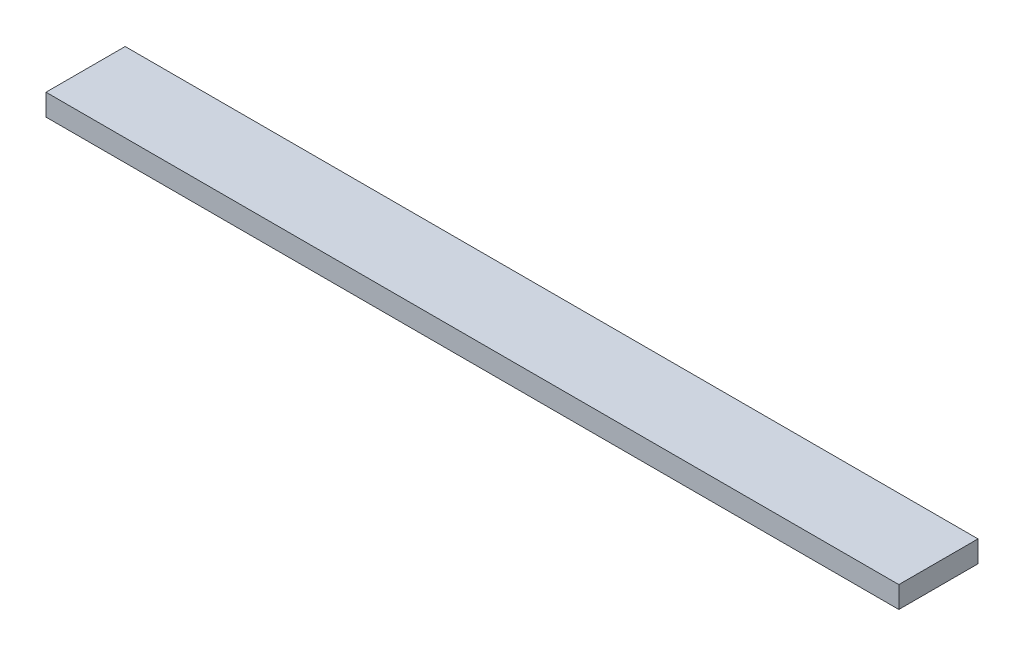
ISO-10303-21;
HEADER;
FILE_DESCRIPTION(('STEP AP214'),'2;1');
FILE_NAME('part.step','',(''),(''),'','','');
FILE_SCHEMA(('AUTOMOTIVE_DESIGN { 1 0 10303 214 1 1 1 1 }'));
ENDSEC;
DATA;
#1=APPLICATION_CONTEXT('core data for automotive mechanical design processes');
#2=APPLICATION_PROTOCOL_DEFINITION('international standard','automotive_design',2000,#1);
#3=PRODUCT_CONTEXT('',#1,'mechanical');
#4=PRODUCT('Part','Part','',(#3));
#5=PRODUCT_RELATED_PRODUCT_CATEGORY('part','',(#4));
#6=PRODUCT_DEFINITION_FORMATION('','',#4);
#7=PRODUCT_DEFINITION_CONTEXT('part definition',#1,'design');
#8=PRODUCT_DEFINITION('design','',#6,#7);
#9=PRODUCT_DEFINITION_SHAPE('','',#8);
#10=(LENGTH_UNIT() NAMED_UNIT(*) SI_UNIT(.MILLI.,.METRE.));
#11=(NAMED_UNIT(*) PLANE_ANGLE_UNIT() SI_UNIT($,.RADIAN.));
#12=(NAMED_UNIT(*) SI_UNIT($,.STERADIAN.) SOLID_ANGLE_UNIT());
#13=UNCERTAINTY_MEASURE_WITH_UNIT(LENGTH_MEASURE(1.E-05),#10,'distance_accuracy_value','');
#14=(GEOMETRIC_REPRESENTATION_CONTEXT(3) GLOBAL_UNCERTAINTY_ASSIGNED_CONTEXT((#13)) GLOBAL_UNIT_ASSIGNED_CONTEXT((#10,
#11,#12)) REPRESENTATION_CONTEXT('',''));
#15=CARTESIAN_POINT('',(0.,0.,0.));
#16=DIRECTION('',(0.,0.,1.));
#17=DIRECTION('',(1.,0.,0.));
#18=AXIS2_PLACEMENT_3D('',#15,#16,#17);
#19=CARTESIAN_POINT('',(0.,19.05,0.));
#20=DIRECTION('',(1.,0.,0.));
#21=DIRECTION('',(0.,0.,-1.));
#22=AXIS2_PLACEMENT_3D('',#19,#20,#21);
#23=PLANE('',#22);
#24=DIRECTION('',(0.,0.,1.));
#25=VECTOR('',#24,1.);
#26=CARTESIAN_POINT('',(0.,0.,0.));
#27=LINE('',#26,#25);
#28=CARTESIAN_POINT('',(0.,0.,-69.85));
#29=VERTEX_POINT('',#28);
#30=CARTESIAN_POINT('',(0.,0.,0.));
#31=VERTEX_POINT('',#30);
#32=EDGE_CURVE('E101',#29,#31,#27,.T.);
#33=ORIENTED_EDGE('',*,*,#32,.T.);
#34=DIRECTION('',(0.,-1.,0.));
#35=VECTOR('',#34,1.);
#36=CARTESIAN_POINT('',(0.,19.05,0.));
#37=LINE('',#36,#35);
#38=CARTESIAN_POINT('',(0.,19.05,0.));
#39=VERTEX_POINT('',#38);
#40=EDGE_CURVE('E11',#39,#31,#37,.T.);
#41=ORIENTED_EDGE('',*,*,#40,.F.);
#42=DIRECTION('',(0.,0.,1.));
#43=VECTOR('',#42,1.);
#44=CARTESIAN_POINT('',(0.,19.05,0.));
#45=LINE('',#44,#43);
#46=CARTESIAN_POINT('',(0.,19.05,-69.85));
#47=VERTEX_POINT('',#46);
#48=EDGE_CURVE('E89',#47,#39,#45,.T.);
#49=ORIENTED_EDGE('',*,*,#48,.F.);
#50=DIRECTION('',(0.,-1.,0.));
#51=VECTOR('',#50,1.);
#52=CARTESIAN_POINT('',(0.,19.05,-69.85));
#53=LINE('',#52,#51);
#54=EDGE_CURVE('E97',#47,#29,#53,.T.);
#55=ORIENTED_EDGE('',*,*,#54,.T.);
#56=EDGE_LOOP('',(#33,#41,#49,#55));
#57=FACE_BOUND('',#56,.T.);
#58=ADVANCED_FACE('F38',(#57),#23,.F.);
#59=CARTESIAN_POINT('',(0.,19.05,0.));
#60=DIRECTION('',(0.,0.,-1.));
#61=DIRECTION('',(-1.,0.,0.));
#62=AXIS2_PLACEMENT_3D('',#59,#60,#61);
#63=PLANE('',#62);
#64=DIRECTION('',(1.,0.,0.));
#65=VECTOR('',#64,1.);
#66=CARTESIAN_POINT('',(0.,0.,0.));
#67=LINE('',#66,#65);
#68=CARTESIAN_POINT('',(752.475,0.,0.));
#69=VERTEX_POINT('',#68);
#70=EDGE_CURVE('E93',#31,#69,#67,.T.);
#71=ORIENTED_EDGE('',*,*,#70,.T.);
#72=DIRECTION('',(0.,-1.,0.));
#73=VECTOR('',#72,1.);
#74=CARTESIAN_POINT('',(752.475,19.05,0.));
#75=LINE('',#74,#73);
#76=CARTESIAN_POINT('',(752.475,19.05,0.));
#77=VERTEX_POINT('',#76);
#78=EDGE_CURVE('E46',#77,#69,#75,.T.);
#79=ORIENTED_EDGE('',*,*,#78,.F.);
#80=DIRECTION('',(1.,0.,0.));
#81=VECTOR('',#80,1.);
#82=CARTESIAN_POINT('',(0.,19.05,0.));
#83=LINE('',#82,#81);
#84=EDGE_CURVE('E84',#39,#77,#83,.T.);
#85=ORIENTED_EDGE('',*,*,#84,.F.);
#86=ORIENTED_EDGE('',*,*,#40,.T.);
#87=EDGE_LOOP('',(#71,#79,#85,#86));
#88=FACE_BOUND('',#87,.T.);
#89=ADVANCED_FACE('F92',(#88),#63,.F.);
#90=CARTESIAN_POINT('',(752.475,19.05,0.));
#91=DIRECTION('',(-1.,0.,0.));
#92=DIRECTION('',(0.,0.,1.));
#93=AXIS2_PLACEMENT_3D('',#90,#91,#92);
#94=PLANE('',#93);
#95=DIRECTION('',(0.,0.,-1.));
#96=VECTOR('',#95,1.);
#97=CARTESIAN_POINT('',(752.475,0.,0.));
#98=LINE('',#97,#96);
#99=CARTESIAN_POINT('',(752.475,0.,-69.85));
#100=VERTEX_POINT('',#99);
#101=EDGE_CURVE('E71',#69,#100,#98,.T.);
#102=ORIENTED_EDGE('',*,*,#101,.T.);
#103=DIRECTION('',(0.,-1.,0.));
#104=VECTOR('',#103,1.);
#105=CARTESIAN_POINT('',(752.475,19.05,-69.85));
#106=LINE('',#105,#104);
#107=CARTESIAN_POINT('',(752.475,19.05,-69.85));
#108=VERTEX_POINT('',#107);
#109=EDGE_CURVE('E94',#108,#100,#106,.T.);
#110=ORIENTED_EDGE('',*,*,#109,.F.);
#111=DIRECTION('',(0.,0.,-1.));
#112=VECTOR('',#111,1.);
#113=CARTESIAN_POINT('',(752.475,19.05,0.));
#114=LINE('',#113,#112);
#115=EDGE_CURVE('E87',#77,#108,#114,.T.);
#116=ORIENTED_EDGE('',*,*,#115,.F.);
#117=ORIENTED_EDGE('',*,*,#78,.T.);
#118=EDGE_LOOP('',(#102,#110,#116,#117));
#119=FACE_BOUND('',#118,.T.);
#120=ADVANCED_FACE('F95',(#119),#94,.F.);
#121=CARTESIAN_POINT('',(0.,19.05,-69.85));
#122=DIRECTION('',(0.,0.,1.));
#123=DIRECTION('',(1.,0.,0.));
#124=AXIS2_PLACEMENT_3D('',#121,#122,#123);
#125=PLANE('',#124);
#126=DIRECTION('',(-1.,0.,0.));
#127=VECTOR('',#126,1.);
#128=CARTESIAN_POINT('',(0.,0.,-69.85));
#129=LINE('',#128,#127);
#130=EDGE_CURVE('E77',#100,#29,#129,.T.);
#131=ORIENTED_EDGE('',*,*,#130,.T.);
#132=ORIENTED_EDGE('',*,*,#54,.F.);
#133=DIRECTION('',(-1.,0.,0.));
#134=VECTOR('',#133,1.);
#135=CARTESIAN_POINT('',(0.,19.05,-69.85));
#136=LINE('',#135,#134);
#137=EDGE_CURVE('E54',#108,#47,#136,.T.);
#138=ORIENTED_EDGE('',*,*,#137,.F.);
#139=ORIENTED_EDGE('',*,*,#109,.T.);
#140=EDGE_LOOP('',(#131,#132,#138,#139));
#141=FACE_BOUND('',#140,.T.);
#142=ADVANCED_FACE('F108',(#141),#125,.F.);
#143=CARTESIAN_POINT('',(0.,19.05,0.));
#144=DIRECTION('',(0.,-1.,0.));
#145=DIRECTION('',(0.,0.,-1.));
#146=AXIS2_PLACEMENT_3D('',#143,#144,#145);
#147=PLANE('',#146);
#148=ORIENTED_EDGE('',*,*,#48,.T.);
#149=ORIENTED_EDGE('',*,*,#84,.T.);
#150=ORIENTED_EDGE('',*,*,#115,.T.);
#151=ORIENTED_EDGE('',*,*,#137,.T.);
#152=EDGE_LOOP('',(#148,#149,#150,#151));
#153=FACE_BOUND('',#152,.T.);
#154=ADVANCED_FACE('F85',(#153),#147,.F.);
#155=CARTESIAN_POINT('',(0.,0.,0.));
#156=DIRECTION('',(0.,-1.,0.));
#157=DIRECTION('',(0.,0.,-1.));
#158=AXIS2_PLACEMENT_3D('',#155,#156,#157);
#159=PLANE('',#158);
#160=ORIENTED_EDGE('',*,*,#32,.F.);
#161=ORIENTED_EDGE('',*,*,#130,.F.);
#162=ORIENTED_EDGE('',*,*,#101,.F.);
#163=ORIENTED_EDGE('',*,*,#70,.F.);
#164=EDGE_LOOP('',(#160,#161,#162,#163));
#165=FACE_BOUND('',#164,.T.);
#166=ADVANCED_FACE('F111',(#165),#159,.T.);
#167=CLOSED_SHELL('',(#58,#89,#120,#142,#154,#166));
#168=MANIFOLD_SOLID_BREP('B2',#167);
#169=ADVANCED_BREP_SHAPE_REPRESENTATION('',(#18,#168),#14);
#170=SHAPE_DEFINITION_REPRESENTATION(#9,#169);
ENDSEC;
END-ISO-10303-21;
